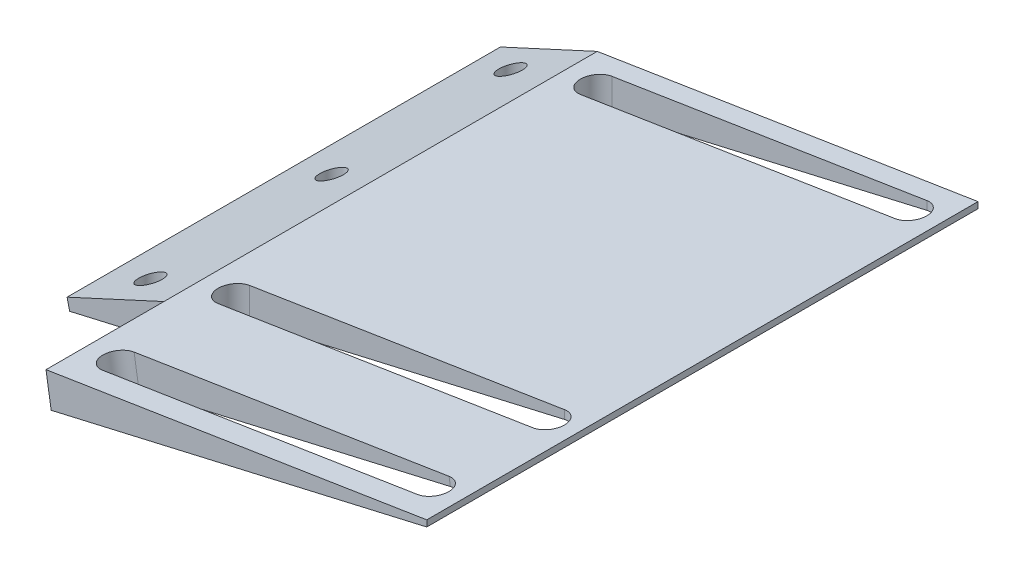
ISO-10303-21;
HEADER;
FILE_DESCRIPTION(('STEP AP214'),'2;1');
FILE_NAME('part.step','',(''),(''),'','','');
FILE_SCHEMA(('AUTOMOTIVE_DESIGN { 1 0 10303 214 1 1 1 1 }'));
ENDSEC;
DATA;
#1=APPLICATION_CONTEXT('core data for automotive mechanical design processes');
#2=APPLICATION_PROTOCOL_DEFINITION('international standard','automotive_design',2000,#1);
#3=PRODUCT_CONTEXT('',#1,'mechanical');
#4=PRODUCT('Part','Part','',(#3));
#5=PRODUCT_RELATED_PRODUCT_CATEGORY('part','',(#4));
#6=PRODUCT_DEFINITION_FORMATION('','',#4);
#7=PRODUCT_DEFINITION_CONTEXT('part definition',#1,'design');
#8=PRODUCT_DEFINITION('design','',#6,#7);
#9=PRODUCT_DEFINITION_SHAPE('','',#8);
#10=(LENGTH_UNIT() NAMED_UNIT(*) SI_UNIT(.MILLI.,.METRE.));
#11=(NAMED_UNIT(*) PLANE_ANGLE_UNIT() SI_UNIT($,.RADIAN.));
#12=(NAMED_UNIT(*) SI_UNIT($,.STERADIAN.) SOLID_ANGLE_UNIT());
#13=UNCERTAINTY_MEASURE_WITH_UNIT(LENGTH_MEASURE(1.E-05),#10,'distance_accuracy_value','');
#14=(GEOMETRIC_REPRESENTATION_CONTEXT(3) GLOBAL_UNCERTAINTY_ASSIGNED_CONTEXT((#13)) GLOBAL_UNIT_ASSIGNED_CONTEXT((#10,
#11,#12)) REPRESENTATION_CONTEXT('',''));
#15=CARTESIAN_POINT('',(0.,0.,0.));
#16=DIRECTION('',(0.,0.,1.));
#17=DIRECTION('',(1.,0.,0.));
#18=AXIS2_PLACEMENT_3D('',#15,#16,#17);
#19=CARTESIAN_POINT('',(0.,0.,110.));
#20=DIRECTION('',(0.156434465040224,-0.987688340595139,0.));
#21=DIRECTION('',(0.987688340595139,0.156434465040224,0.));
#22=AXIS2_PLACEMENT_3D('',#19,#20,#21);
#23=PLANE('',#22);
#24=DIRECTION('',(0.987688340595139,0.156434465040224,0.));
#25=VECTOR('',#24,1.);
#26=CARTESIAN_POINT('',(0.,0.,126.324079107667));
#27=LINE('',#26,#25);
#28=CARTESIAN_POINT('',(-109.820404962566,-17.3938433762093,126.324079107667));
#29=VERTEX_POINT('',#28);
#30=CARTESIAN_POINT('',(-29.8204049625664,-4.72308815024691,126.324079107667));
#31=VERTEX_POINT('',#30);
#32=EDGE_CURVE('E177',#29,#31,#27,.T.);
#33=ORIENTED_EDGE('',*,*,#32,.T.);
#34=CARTESIAN_POINT('',(-29.8204049625664,-4.72308815024691,130.324079107667));
#35=DIRECTION('',(0.156434465040224,-0.987688340595139,0.));
#36=DIRECTION('',(0.987688340595139,0.156434465040224,0.));
#37=AXIS2_PLACEMENT_3D('',#34,#35,#36);
#38=CIRCLE('',#37,4.);
#39=CARTESIAN_POINT('',(-29.8204049625664,-4.72308815024691,134.324079107667));
#40=VERTEX_POINT('',#39);
#41=EDGE_CURVE('E215',#31,#40,#38,.T.);
#42=ORIENTED_EDGE('',*,*,#41,.T.);
#43=DIRECTION('',(-0.987688340595139,-0.156434465040224,0.));
#44=VECTOR('',#43,1.);
#45=CARTESIAN_POINT('',(0.,0.,134.324079107667));
#46=LINE('',#45,#44);
#47=CARTESIAN_POINT('',(-109.820404962566,-17.3938433762093,134.324079107667));
#48=VERTEX_POINT('',#47);
#49=EDGE_CURVE('E211',#40,#48,#46,.T.);
#50=ORIENTED_EDGE('',*,*,#49,.T.);
#51=CARTESIAN_POINT('',(-109.820404962566,-17.3938433762093,130.324079107667));
#52=DIRECTION('',(0.156434465040224,-0.987688340595139,0.));
#53=DIRECTION('',(0.987688340595139,0.156434465040224,0.));
#54=AXIS2_PLACEMENT_3D('',#51,#52,#53);
#55=CIRCLE('',#54,4.00000000000002);
#56=EDGE_CURVE('E207',#48,#29,#55,.T.);
#57=ORIENTED_EDGE('',*,*,#56,.T.);
#58=EDGE_LOOP('',(#33,#42,#50,#57));
#59=FACE_BOUND('',#58,.T.);
#60=DIRECTION('',(0.987688340595139,0.156434465040224,0.));
#61=VECTOR('',#60,1.);
#62=CARTESIAN_POINT('',(0.,0.,5.00000000000002));
#63=LINE('',#62,#61);
#64=CARTESIAN_POINT('',(-109.820404962566,-17.3938433762093,4.99999999999998));
#65=VERTEX_POINT('',#64);
#66=CARTESIAN_POINT('',(-29.8204049625664,-4.72308815024691,5.00000000000001));
#67=VERTEX_POINT('',#66);
#68=EDGE_CURVE('E290',#65,#67,#63,.T.);
#69=ORIENTED_EDGE('',*,*,#68,.T.);
#70=CARTESIAN_POINT('',(-29.8204049625664,-4.7230881502469,8.99999999999998));
#71=DIRECTION('',(0.156434465040224,-0.987688340595139,0.));
#72=DIRECTION('',(0.987688340595139,0.156434465040224,0.));
#73=AXIS2_PLACEMENT_3D('',#70,#71,#72);
#74=ELLIPSE('',#73,4.049860503152,3.99999999999999);
#75=CARTESIAN_POINT('',(-29.8204049625664,-4.72308815024691,13.));
#76=VERTEX_POINT('',#75);
#77=EDGE_CURVE('E302',#67,#76,#74,.T.);
#78=ORIENTED_EDGE('',*,*,#77,.T.);
#79=DIRECTION('',(-0.987688340595139,-0.156434465040224,0.));
#80=VECTOR('',#79,1.);
#81=CARTESIAN_POINT('',(0.,0.,13.));
#82=LINE('',#81,#80);
#83=CARTESIAN_POINT('',(-109.820404962566,-17.3938433762093,13.));
#84=VERTEX_POINT('',#83);
#85=EDGE_CURVE('E298',#76,#84,#82,.T.);
#86=ORIENTED_EDGE('',*,*,#85,.T.);
#87=CARTESIAN_POINT('',(-109.820404962566,-17.3938433762093,8.99999999999997));
#88=DIRECTION('',(0.156434465040224,-0.987688340595139,0.));
#89=DIRECTION('',(0.987688340595139,0.156434465040224,0.));
#90=AXIS2_PLACEMENT_3D('',#87,#88,#89);
#91=ELLIPSE('',#90,4.04986050315203,4.00000000000003);
#92=EDGE_CURVE('E294',#84,#65,#91,.T.);
#93=ORIENTED_EDGE('',*,*,#92,.T.);
#94=EDGE_LOOP('',(#69,#78,#86,#93));
#95=FACE_BOUND('',#94,.T.);
#96=DIRECTION('',(0.987688340595139,0.156434465040224,0.));
#97=VECTOR('',#96,1.);
#98=CARTESIAN_POINT('',(0.,0.,97.));
#99=LINE('',#98,#97);
#100=CARTESIAN_POINT('',(-109.820404962566,-17.3938433762093,97.));
#101=VERTEX_POINT('',#100);
#102=CARTESIAN_POINT('',(-29.8204049625664,-4.72308815024691,97.));
#103=VERTEX_POINT('',#102);
#104=EDGE_CURVE('E274',#101,#103,#99,.T.);
#105=ORIENTED_EDGE('',*,*,#104,.T.);
#106=CARTESIAN_POINT('',(-29.8204049625664,-4.7230881502469,101.));
#107=DIRECTION('',(0.156434465040224,-0.987688340595139,0.));
#108=DIRECTION('',(0.987688340595139,0.156434465040224,0.));
#109=AXIS2_PLACEMENT_3D('',#106,#107,#108);
#110=ELLIPSE('',#109,4.049860503152,3.99999999999999);
#111=CARTESIAN_POINT('',(-29.8204049625664,-4.72308815024691,105.));
#112=VERTEX_POINT('',#111);
#113=EDGE_CURVE('E286',#103,#112,#110,.T.);
#114=ORIENTED_EDGE('',*,*,#113,.T.);
#115=DIRECTION('',(-0.987688340595139,-0.156434465040224,0.));
#116=VECTOR('',#115,1.);
#117=CARTESIAN_POINT('',(0.,0.,105.));
#118=LINE('',#117,#116);
#119=CARTESIAN_POINT('',(-109.820404962566,-17.3938433762093,105.));
#120=VERTEX_POINT('',#119);
#121=EDGE_CURVE('E282',#112,#120,#118,.T.);
#122=ORIENTED_EDGE('',*,*,#121,.T.);
#123=CARTESIAN_POINT('',(-109.820404962566,-17.3938433762093,101.));
#124=DIRECTION('',(0.156434465040224,-0.987688340595139,0.));
#125=DIRECTION('',(0.987688340595139,0.156434465040224,0.));
#126=AXIS2_PLACEMENT_3D('',#123,#124,#125);
#127=ELLIPSE('',#126,4.04986050315204,4.00000000000003);
#128=EDGE_CURVE('E278',#120,#101,#127,.T.);
#129=ORIENTED_EDGE('',*,*,#128,.T.);
#130=EDGE_LOOP('',(#105,#114,#122,#129));
#131=FACE_BOUND('',#130,.T.);
#132=DIRECTION('',(0.,0.,1.));
#133=VECTOR('',#132,1.);
#134=CARTESIAN_POINT('',(-21.8204049625664,-3.45601262765067,0.));
#135=LINE('',#134,#133);
#136=CARTESIAN_POINT('',(-21.8204049625664,-3.45601262765067,0.));
#137=VERTEX_POINT('',#136);
#138=CARTESIAN_POINT('',(-21.8204049625664,-3.45601262765067,140.));
#139=VERTEX_POINT('',#138);
#140=EDGE_CURVE('E310',#137,#139,#135,.T.);
#141=ORIENTED_EDGE('',*,*,#140,.F.);
#142=DIRECTION('',(-0.987688340595139,-0.156434465040224,0.));
#143=VECTOR('',#142,1.);
#144=CARTESIAN_POINT('',(0.,0.,0.));
#145=LINE('',#144,#143);
#146=CARTESIAN_POINT('',(-118.522600871417,-18.7721358048269,0.));
#147=VERTEX_POINT('',#146);
#148=EDGE_CURVE('E313',#137,#147,#145,.T.);
#149=ORIENTED_EDGE('',*,*,#148,.T.);
#150=DIRECTION('',(0.,0.,-1.));
#151=VECTOR('',#150,1.);
#152=CARTESIAN_POINT('',(-118.522600871417,-18.7721358048269,110.));
#153=LINE('',#152,#151);
#154=CARTESIAN_POINT('',(-118.522600871417,-18.7721358048269,110.045443527415));
#155=VERTEX_POINT('',#154);
#156=EDGE_CURVE('E337',#155,#147,#153,.T.);
#157=ORIENTED_EDGE('',*,*,#156,.F.);
#158=CARTESIAN_POINT('',(-118.522600871417,-18.7721358048269,140.));
#159=VERTEX_POINT('',#158);
#160=EDGE_CURVE('E185',#159,#155,#153,.T.);
#161=ORIENTED_EDGE('',*,*,#160,.F.);
#162=DIRECTION('',(-0.987688340595139,-0.156434465040224,0.));
#163=VECTOR('',#162,1.);
#164=CARTESIAN_POINT('',(-21.8204049625664,-3.45601262765067,140.));
#165=LINE('',#164,#163);
#166=EDGE_CURVE('E225',#139,#159,#165,.T.);
#167=ORIENTED_EDGE('',*,*,#166,.F.);
#168=EDGE_LOOP('',(#141,#149,#157,#161,#167));
#169=FACE_BOUND('',#168,.T.);
#170=ADVANCED_FACE('F39',(#59,#95,#131,#169),#23,.F.);
#171=CARTESIAN_POINT('',(0.,0.,110.));
#172=DIRECTION('',(-0.224951054343859,0.974370064785237,0.));
#173=DIRECTION('',(-0.974370064785237,-0.224951054343859,0.));
#174=AXIS2_PLACEMENT_3D('',#171,#172,#173);
#175=PLANE('',#174);
#176=DIRECTION('',(0.974370064785237,0.224951054343859,0.));
#177=VECTOR('',#176,1.);
#178=CARTESIAN_POINT('',(0.,0.,134.324079107667));
#179=LINE('',#178,#177);
#180=CARTESIAN_POINT('',(-108.604108947823,-25.0732341815868,134.324079107667));
#181=VERTEX_POINT('',#180);
#182=CARTESIAN_POINT('',(-29.4901344656915,-6.80833400014363,134.324079107667));
#183=VERTEX_POINT('',#182);
#184=EDGE_CURVE('E47',#181,#183,#179,.T.);
#185=ORIENTED_EDGE('',*,*,#184,.T.);
#186=CARTESIAN_POINT('',(-29.4901344656915,-6.80833400014362,130.324079107667));
#187=DIRECTION('',(-0.224951054343859,0.974370064785237,0.));
#188=DIRECTION('',(0.974370064785237,0.224951054343859,0.));
#189=AXIS2_PLACEMENT_3D('',#186,#187,#188);
#190=ELLIPSE('',#189,4.00976759232469,4.);
#191=CARTESIAN_POINT('',(-29.4901344656915,-6.80833400014363,126.324079107667));
#192=VERTEX_POINT('',#191);
#193=EDGE_CURVE('E11',#183,#192,#190,.T.);
#194=ORIENTED_EDGE('',*,*,#193,.T.);
#195=DIRECTION('',(-0.974370064785237,-0.224951054343859,0.));
#196=VECTOR('',#195,1.);
#197=CARTESIAN_POINT('',(0.,0.,126.324079107667));
#198=LINE('',#197,#196);
#199=CARTESIAN_POINT('',(-108.604108947823,-25.0732341815868,126.324079107667));
#200=VERTEX_POINT('',#199);
#201=EDGE_CURVE('E386',#192,#200,#198,.T.);
#202=ORIENTED_EDGE('',*,*,#201,.T.);
#203=CARTESIAN_POINT('',(-108.604108947823,-25.0732341815868,130.324079107667));
#204=DIRECTION('',(-0.224951054343859,0.974370064785237,0.));
#205=DIRECTION('',(0.974370064785237,0.224951054343859,0.));
#206=AXIS2_PLACEMENT_3D('',#203,#204,#205);
#207=ELLIPSE('',#206,4.00976759232471,4.00000000000002);
#208=EDGE_CURVE('E390',#200,#181,#207,.T.);
#209=ORIENTED_EDGE('',*,*,#208,.T.);
#210=EDGE_LOOP('',(#185,#194,#202,#209));
#211=FACE_BOUND('',#210,.T.);
#212=DIRECTION('',(0.974370064785237,0.224951054343859,0.));
#213=VECTOR('',#212,1.);
#214=CARTESIAN_POINT('',(0.,0.,13.));
#215=LINE('',#214,#213);
#216=CARTESIAN_POINT('',(-109.820404962566,-25.3540382423838,13.));
#217=VERTEX_POINT('',#216);
#218=CARTESIAN_POINT('',(-29.8204049625664,-6.88458295233928,13.));
#219=VERTEX_POINT('',#218);
#220=EDGE_CURVE('E373',#217,#219,#215,.T.);
#221=ORIENTED_EDGE('',*,*,#220,.T.);
#222=CARTESIAN_POINT('',(-29.8204049625664,-6.88458295233927,8.99999999999998));
#223=DIRECTION('',(-0.224951054343859,0.974370064785237,0.));
#224=DIRECTION('',(0.974370064785237,0.224951054343859,0.));
#225=AXIS2_PLACEMENT_3D('',#222,#223,#224);
#226=ELLIPSE('',#225,4.10521643117355,3.99999999999999);
#227=CARTESIAN_POINT('',(-29.8204049625664,-6.88458295233928,5.00000000000001));
#228=VERTEX_POINT('',#227);
#229=EDGE_CURVE('E377',#219,#228,#226,.T.);
#230=ORIENTED_EDGE('',*,*,#229,.T.);
#231=DIRECTION('',(-0.974370064785237,-0.224951054343859,0.));
#232=VECTOR('',#231,1.);
#233=CARTESIAN_POINT('',(0.,0.,5.00000000000002));
#234=LINE('',#233,#232);
#235=CARTESIAN_POINT('',(-109.820404962566,-25.3540382423838,4.99999999999998));
#236=VERTEX_POINT('',#235);
#237=EDGE_CURVE('E365',#228,#236,#234,.T.);
#238=ORIENTED_EDGE('',*,*,#237,.T.);
#239=CARTESIAN_POINT('',(-109.820404962566,-25.3540382423838,8.99999999999997));
#240=DIRECTION('',(-0.224951054343859,0.974370064785237,0.));
#241=DIRECTION('',(0.974370064785237,0.224951054343859,0.));
#242=AXIS2_PLACEMENT_3D('',#239,#240,#241);
#243=ELLIPSE('',#242,4.10521643117359,4.00000000000003);
#244=EDGE_CURVE('E369',#236,#217,#243,.T.);
#245=ORIENTED_EDGE('',*,*,#244,.T.);
#246=EDGE_LOOP('',(#221,#230,#238,#245));
#247=FACE_BOUND('',#246,.T.);
#248=CARTESIAN_POINT('',(-130.995623221144,-30.2427225784305,101.));
#249=DIRECTION('',(-0.224951054343859,0.974370064785237,0.));
#250=DIRECTION('',(0.974370064785237,0.224951054343859,0.));
#251=AXIS2_PLACEMENT_3D('',#248,#249,#250);
#252=ELLIPSE('',#251,3.07891232338016,2.99999999999999);
#253=CARTESIAN_POINT('',(-127.995623221144,-29.5501180050538,101.));
#254=VERTEX_POINT('',#253);
#255=EDGE_CURVE('E270',#254,#254,#252,.T.);
#256=ORIENTED_EDGE('',*,*,#255,.T.);
#257=EDGE_LOOP('',(#256));
#258=FACE_BOUND('',#257,.T.);
#259=CARTESIAN_POINT('',(-131.538244407152,-30.3679965501105,8.99999999999997));
#260=DIRECTION('',(-0.224951054343859,0.974370064785237,0.));
#261=DIRECTION('',(0.974370064785237,0.224951054343859,0.));
#262=AXIS2_PLACEMENT_3D('',#259,#260,#261);
#263=ELLIPSE('',#262,3.07891232338016,2.99999999999999);
#264=CARTESIAN_POINT('',(-128.538244407152,-29.6753919767338,8.99999999999997));
#265=VERTEX_POINT('',#264);
#266=EDGE_CURVE('E265',#265,#265,#263,.T.);
#267=ORIENTED_EDGE('',*,*,#266,.T.);
#268=EDGE_LOOP('',(#267));
#269=FACE_BOUND('',#268,.T.);
#270=CARTESIAN_POINT('',(-130.995623221142,-30.2427225784299,55.));
#271=DIRECTION('',(-0.224951054343859,0.974370064785237,0.));
#272=DIRECTION('',(0.974370064785237,0.224951054343859,0.));
#273=AXIS2_PLACEMENT_3D('',#270,#271,#272);
#274=ELLIPSE('',#273,3.07891232338016,2.99999999999999);
#275=CARTESIAN_POINT('',(-127.995623221142,-29.5501180050532,55.));
#276=VERTEX_POINT('',#275);
#277=EDGE_CURVE('E260',#276,#276,#274,.T.);
#278=ORIENTED_EDGE('',*,*,#277,.T.);
#279=EDGE_LOOP('',(#278));
#280=FACE_BOUND('',#279,.T.);
#281=DIRECTION('',(0.974370064785237,0.224951054343859,0.));
#282=VECTOR('',#281,1.);
#283=CARTESIAN_POINT('',(0.,0.,105.));
#284=LINE('',#283,#282);
#285=CARTESIAN_POINT('',(-109.820404962566,-25.3540382423838,105.));
#286=VERTEX_POINT('',#285);
#287=CARTESIAN_POINT('',(-29.8204049625664,-6.88458295233928,105.));
#288=VERTEX_POINT('',#287);
#289=EDGE_CURVE('E357',#286,#288,#284,.T.);
#290=ORIENTED_EDGE('',*,*,#289,.T.);
#291=CARTESIAN_POINT('',(-29.8204049625664,-6.88458295233927,101.));
#292=DIRECTION('',(-0.224951054343859,0.974370064785237,0.));
#293=DIRECTION('',(0.974370064785237,0.224951054343859,0.));
#294=AXIS2_PLACEMENT_3D('',#291,#292,#293);
#295=ELLIPSE('',#294,4.10521643117355,3.99999999999999);
#296=CARTESIAN_POINT('',(-29.8204049625664,-6.88458295233928,97.));
#297=VERTEX_POINT('',#296);
#298=EDGE_CURVE('E361',#288,#297,#295,.T.);
#299=ORIENTED_EDGE('',*,*,#298,.T.);
#300=DIRECTION('',(-0.974370064785237,-0.224951054343859,0.));
#301=VECTOR('',#300,1.);
#302=CARTESIAN_POINT('',(0.,0.,97.));
#303=LINE('',#302,#301);
#304=CARTESIAN_POINT('',(-109.820404962566,-25.3540382423838,97.));
#305=VERTEX_POINT('',#304);
#306=EDGE_CURVE('E340',#297,#305,#303,.T.);
#307=ORIENTED_EDGE('',*,*,#306,.T.);
#308=CARTESIAN_POINT('',(-109.820404962566,-25.3540382423838,101.));
#309=DIRECTION('',(-0.224951054343859,0.974370064785237,0.));
#310=DIRECTION('',(0.974370064785237,0.224951054343859,0.));
#311=AXIS2_PLACEMENT_3D('',#308,#309,#310);
#312=ELLIPSE('',#311,4.10521643117359,4.00000000000003);
#313=EDGE_CURVE('E353',#305,#286,#312,.T.);
#314=ORIENTED_EDGE('',*,*,#313,.T.);
#315=EDGE_LOOP('',(#290,#299,#307,#314));
#316=FACE_BOUND('',#315,.T.);
#317=DIRECTION('',(0.974370064785237,0.224951054343859,0.));
#318=VECTOR('',#317,1.);
#319=CARTESIAN_POINT('',(-142.475314214893,-32.8930180728377,140.));
#320=LINE('',#319,#318);
#321=CARTESIAN_POINT('',(-117.209925261215,-27.0600434270182,140.));
#322=VERTEX_POINT('',#321);
#323=CARTESIAN_POINT('',(-21.8204049625664,-5.03763742333482,140.));
#324=VERTEX_POINT('',#323);
#325=EDGE_CURVE('E191',#322,#324,#320,.T.);
#326=ORIENTED_EDGE('',*,*,#325,.F.);
#327=DIRECTION('',(0.,0.,-1.));
#328=VECTOR('',#327,1.);
#329=CARTESIAN_POINT('',(-117.209925261215,-27.0600434270182,110.));
#330=LINE('',#329,#328);
#331=CARTESIAN_POINT('',(-117.209925261215,-27.0600434270182,110.045443527415));
#332=VERTEX_POINT('',#331);
#333=EDGE_CURVE('E182',#322,#332,#330,.T.);
#334=ORIENTED_EDGE('',*,*,#333,.T.);
#335=DIRECTION('',(-0.974370064785237,-0.224951054343859,0.));
#336=VECTOR('',#335,1.);
#337=CARTESIAN_POINT('',(0.,0.,110.045443527415));
#338=LINE('',#337,#336);
#339=CARTESIAN_POINT('',(-142.475314214893,-32.8930180728377,110.045443527415));
#340=VERTEX_POINT('',#339);
#341=EDGE_CURVE('E166',#332,#340,#338,.T.);
#342=ORIENTED_EDGE('',*,*,#341,.T.);
#343=DIRECTION('',(0.,0.,-1.));
#344=VECTOR('',#343,1.);
#345=CARTESIAN_POINT('',(-142.475314214893,-32.8930180728377,110.));
#346=LINE('',#345,#344);
#347=CARTESIAN_POINT('',(-142.475314214893,-32.8930180728377,0.));
#348=VERTEX_POINT('',#347);
#349=EDGE_CURVE('E331',#340,#348,#346,.T.);
#350=ORIENTED_EDGE('',*,*,#349,.T.);
#351=DIRECTION('',(0.974370064785237,0.224951054343859,0.));
#352=VECTOR('',#351,1.);
#353=CARTESIAN_POINT('',(0.,0.,0.));
#354=LINE('',#353,#352);
#355=CARTESIAN_POINT('',(-21.8204049625664,-5.03763742333482,0.));
#356=VERTEX_POINT('',#355);
#357=EDGE_CURVE('E327',#348,#356,#354,.T.);
#358=ORIENTED_EDGE('',*,*,#357,.T.);
#359=DIRECTION('',(0.,0.,1.));
#360=VECTOR('',#359,1.);
#361=CARTESIAN_POINT('',(-21.8204049625664,-5.03763742333482,0.));
#362=LINE('',#361,#360);
#363=EDGE_CURVE('E309',#356,#324,#362,.T.);
#364=ORIENTED_EDGE('',*,*,#363,.T.);
#365=EDGE_LOOP('',(#326,#334,#342,#350,#358,#364));
#366=FACE_BOUND('',#365,.T.);
#367=ADVANCED_FACE('F189',(#211,#247,#258,#269,#280,#316,#366),#175,.F.);
#368=CARTESIAN_POINT('',(0.,0.,0.));
#369=DIRECTION('',(0.,0.,1.));
#370=DIRECTION('',(1.,0.,0.));
#371=AXIS2_PLACEMENT_3D('',#368,#369,#370);
#372=PLANE('',#371);
#373=DIRECTION('',(0.,1.,0.));
#374=VECTOR('',#373,1.);
#375=CARTESIAN_POINT('',(-21.8204049625664,0.,0.));
#376=LINE('',#375,#374);
#377=EDGE_CURVE('E306',#356,#137,#376,.T.);
#378=ORIENTED_EDGE('',*,*,#377,.F.);
#379=ORIENTED_EDGE('',*,*,#357,.F.);
#380=DIRECTION('',(0.224951054343858,-0.974370064785237,0.));
#381=VECTOR('',#380,1.);
#382=CARTESIAN_POINT('',(-143.119166496515,-30.104187448393,0.));
#383=LINE('',#382,#381);
#384=CARTESIAN_POINT('',(-143.119166496515,-30.104187448393,0.));
#385=VERTEX_POINT('',#384);
#386=EDGE_CURVE('E323',#385,#348,#383,.T.);
#387=ORIENTED_EDGE('',*,*,#386,.F.);
#388=DIRECTION('',(-0.908243113161488,-0.418442884268245,0.));
#389=VECTOR('',#388,1.);
#390=CARTESIAN_POINT('',(-118.522600871417,-18.7721358048269,0.));
#391=LINE('',#390,#389);
#392=EDGE_CURVE('E319',#147,#385,#391,.T.);
#393=ORIENTED_EDGE('',*,*,#392,.F.);
#394=ORIENTED_EDGE('',*,*,#148,.F.);
#395=EDGE_LOOP('',(#378,#379,#387,#393,#394));
#396=FACE_BOUND('',#395,.T.);
#397=ADVANCED_FACE('F427',(#396),#372,.F.);
#398=CARTESIAN_POINT('',(-118.522600871417,-18.7721358048269,110.));
#399=DIRECTION('',(0.418442884268245,-0.908243113161488,0.));
#400=DIRECTION('',(0.908243113161488,0.418442884268245,0.));
#401=AXIS2_PLACEMENT_3D('',#398,#399,#400);
#402=PLANE('',#401);
#403=CARTESIAN_POINT('',(-130.995623221144,-24.5186670715433,101.));
#404=DIRECTION('',(0.418442884268245,-0.908243113161488,0.));
#405=DIRECTION('',(0.908243113161488,0.418442884268245,0.));
#406=AXIS2_PLACEMENT_3D('',#403,#404,#405);
#407=ELLIPSE('',#406,3.30308037190323,2.99999999999999);
#408=CARTESIAN_POINT('',(-127.995623221144,-23.1365165937543,101.));
#409=VERTEX_POINT('',#408);
#410=EDGE_CURVE('E269',#409,#409,#407,.T.);
#411=ORIENTED_EDGE('',*,*,#410,.T.);
#412=EDGE_LOOP('',(#411));
#413=FACE_BOUND('',#412,.T.);
#414=CARTESIAN_POINT('',(-131.538244407152,-24.768661782043,8.99999999999997));
#415=DIRECTION('',(0.418442884268245,-0.908243113161488,0.));
#416=DIRECTION('',(0.908243113161488,0.418442884268245,0.));
#417=AXIS2_PLACEMENT_3D('',#414,#415,#416);
#418=ELLIPSE('',#417,3.30308037190323,2.99999999999999);
#419=CARTESIAN_POINT('',(-128.538244407152,-23.386511304254,8.99999999999997));
#420=VERTEX_POINT('',#419);
#421=EDGE_CURVE('E264',#420,#420,#418,.T.);
#422=ORIENTED_EDGE('',*,*,#421,.T.);
#423=EDGE_LOOP('',(#422));
#424=FACE_BOUND('',#423,.T.);
#425=CARTESIAN_POINT('',(-130.995623221142,-24.5186670715421,55.));
#426=DIRECTION('',(0.418442884268245,-0.908243113161488,0.));
#427=DIRECTION('',(0.908243113161488,0.418442884268245,0.));
#428=AXIS2_PLACEMENT_3D('',#425,#426,#427);
#429=ELLIPSE('',#428,3.30308037190323,2.99999999999999);
#430=CARTESIAN_POINT('',(-127.995623221142,-23.1365165937531,55.));
#431=VERTEX_POINT('',#430);
#432=EDGE_CURVE('E249',#431,#431,#429,.T.);
#433=ORIENTED_EDGE('',*,*,#432,.T.);
#434=EDGE_LOOP('',(#433));
#435=FACE_BOUND('',#434,.T.);
#436=DIRECTION('',(0.,0.,-1.));
#437=VECTOR('',#436,1.);
#438=CARTESIAN_POINT('',(-143.119166496515,-30.104187448393,110.));
#439=LINE('',#438,#437);
#440=CARTESIAN_POINT('',(-143.119166496515,-30.104187448393,110.045443527415));
#441=VERTEX_POINT('',#440);
#442=EDGE_CURVE('E334',#441,#385,#439,.T.);
#443=ORIENTED_EDGE('',*,*,#442,.F.);
#444=DIRECTION('',(0.908243113161488,0.418442884268245,0.));
#445=VECTOR('',#444,1.);
#446=CARTESIAN_POINT('',(-118.522600871417,-18.7721358048269,110.045443527415));
#447=LINE('',#446,#445);
#448=EDGE_CURVE('E178',#441,#155,#447,.T.);
#449=ORIENTED_EDGE('',*,*,#448,.T.);
#450=ORIENTED_EDGE('',*,*,#156,.T.);
#451=ORIENTED_EDGE('',*,*,#392,.T.);
#452=EDGE_LOOP('',(#443,#449,#450,#451));
#453=FACE_BOUND('',#452,.T.);
#454=ADVANCED_FACE('F433',(#413,#424,#435,#453),#402,.F.);
#455=CARTESIAN_POINT('',(-143.119166496515,-30.104187448393,110.));
#456=DIRECTION('',(0.974370064785237,0.224951054343858,0.));
#457=DIRECTION('',(-0.224951054343858,0.974370064785237,0.));
#458=AXIS2_PLACEMENT_3D('',#455,#456,#457);
#459=PLANE('',#458);
#460=ORIENTED_EDGE('',*,*,#349,.F.);
#461=DIRECTION('',(-0.224951054343858,0.974370064785237,0.));
#462=VECTOR('',#461,1.);
#463=CARTESIAN_POINT('',(-143.119166496515,-30.104187448393,110.045443527415));
#464=LINE('',#463,#462);
#465=EDGE_CURVE('E172',#340,#441,#464,.T.);
#466=ORIENTED_EDGE('',*,*,#465,.T.);
#467=ORIENTED_EDGE('',*,*,#442,.T.);
#468=ORIENTED_EDGE('',*,*,#386,.T.);
#469=EDGE_LOOP('',(#460,#466,#467,#468));
#470=FACE_BOUND('',#469,.T.);
#471=ADVANCED_FACE('F438',(#470),#459,.F.);
#472=CARTESIAN_POINT('',(-21.8204049625664,0.,0.));
#473=DIRECTION('',(1.,0.,0.));
#474=DIRECTION('',(0.,1.,0.));
#475=AXIS2_PLACEMENT_3D('',#472,#473,#474);
#476=PLANE('',#475);
#477=ORIENTED_EDGE('',*,*,#363,.F.);
#478=ORIENTED_EDGE('',*,*,#377,.T.);
#479=ORIENTED_EDGE('',*,*,#140,.T.);
#480=DIRECTION('',(0.,1.,0.));
#481=VECTOR('',#480,1.);
#482=CARTESIAN_POINT('',(-21.8204049625664,-5.03763742333482,140.));
#483=LINE('',#482,#481);
#484=EDGE_CURVE('E221',#324,#139,#483,.T.);
#485=ORIENTED_EDGE('',*,*,#484,.F.);
#486=EDGE_LOOP('',(#477,#478,#479,#485));
#487=FACE_BOUND('',#486,.T.);
#488=ADVANCED_FACE('F440',(#487),#476,.T.);
#489=CARTESIAN_POINT('',(-130.995623221142,-32.8930180728377,55.));
#490=DIRECTION('',(0.,1.,0.));
#491=DIRECTION('',(0.,0.,1.));
#492=AXIS2_PLACEMENT_3D('',#489,#490,#491);
#493=CYLINDRICAL_SURFACE('',#492,2.99999999999999);
#494=ORIENTED_EDGE('',*,*,#432,.F.);
#495=EDGE_LOOP('',(#494));
#496=FACE_BOUND('',#495,.T.);
#497=ORIENTED_EDGE('',*,*,#277,.F.);
#498=EDGE_LOOP('',(#497));
#499=FACE_BOUND('',#498,.T.);
#500=ADVANCED_FACE('F480',(#496,#499),#493,.F.);
#501=CARTESIAN_POINT('',(-131.538244407152,-32.8930180728377,8.99999999999997));
#502=DIRECTION('',(0.,1.,0.));
#503=DIRECTION('',(0.,0.,1.));
#504=AXIS2_PLACEMENT_3D('',#501,#502,#503);
#505=CYLINDRICAL_SURFACE('',#504,2.99999999999999);
#506=ORIENTED_EDGE('',*,*,#421,.F.);
#507=EDGE_LOOP('',(#506));
#508=FACE_BOUND('',#507,.T.);
#509=ORIENTED_EDGE('',*,*,#266,.F.);
#510=EDGE_LOOP('',(#509));
#511=FACE_BOUND('',#510,.T.);
#512=ADVANCED_FACE('F476',(#508,#511),#505,.F.);
#513=CARTESIAN_POINT('',(-130.995623221144,-32.8930180728377,101.));
#514=DIRECTION('',(0.,1.,0.));
#515=DIRECTION('',(0.,0.,1.));
#516=AXIS2_PLACEMENT_3D('',#513,#514,#515);
#517=CYLINDRICAL_SURFACE('',#516,2.99999999999999);
#518=ORIENTED_EDGE('',*,*,#410,.F.);
#519=EDGE_LOOP('',(#518));
#520=FACE_BOUND('',#519,.T.);
#521=ORIENTED_EDGE('',*,*,#255,.F.);
#522=EDGE_LOOP('',(#521));
#523=FACE_BOUND('',#522,.T.);
#524=ADVANCED_FACE('F479',(#520,#523),#517,.F.);
#525=CARTESIAN_POINT('',(-29.8204049625664,-32.8930180728377,101.));
#526=DIRECTION('',(0.,1.,0.));
#527=DIRECTION('',(0.,0.,1.));
#528=AXIS2_PLACEMENT_3D('',#525,#526,#527);
#529=CYLINDRICAL_SURFACE('',#528,3.99999999999999);
#530=DIRECTION('',(0.,1.,0.));
#531=VECTOR('',#530,1.);
#532=CARTESIAN_POINT('',(-29.8204049625664,-32.8930180728377,97.));
#533=LINE('',#532,#531);
#534=EDGE_CURVE('E234',#297,#103,#533,.T.);
#535=ORIENTED_EDGE('',*,*,#534,.F.);
#536=ORIENTED_EDGE('',*,*,#298,.F.);
#537=DIRECTION('',(0.,1.,0.));
#538=VECTOR('',#537,1.);
#539=CARTESIAN_POINT('',(-29.8204049625664,-32.8930180728377,105.));
#540=LINE('',#539,#538);
#541=EDGE_CURVE('E245',#288,#112,#540,.T.);
#542=ORIENTED_EDGE('',*,*,#541,.T.);
#543=ORIENTED_EDGE('',*,*,#113,.F.);
#544=EDGE_LOOP('',(#535,#536,#542,#543));
#545=FACE_BOUND('',#544,.T.);
#546=ADVANCED_FACE('F499',(#545),#529,.F.);
#547=CARTESIAN_POINT('',(-29.8204049625664,-32.8930180728377,105.));
#548=DIRECTION('',(0.,0.,1.));
#549=DIRECTION('',(1.,0.,0.));
#550=AXIS2_PLACEMENT_3D('',#547,#548,#549);
#551=PLANE('',#550);
#552=ORIENTED_EDGE('',*,*,#541,.F.);
#553=ORIENTED_EDGE('',*,*,#289,.F.);
#554=DIRECTION('',(0.,1.,0.));
#555=VECTOR('',#554,1.);
#556=CARTESIAN_POINT('',(-109.820404962566,-32.8930180728377,105.));
#557=LINE('',#556,#555);
#558=EDGE_CURVE('E250',#286,#120,#557,.T.);
#559=ORIENTED_EDGE('',*,*,#558,.T.);
#560=ORIENTED_EDGE('',*,*,#121,.F.);
#561=EDGE_LOOP('',(#552,#553,#559,#560));
#562=FACE_BOUND('',#561,.T.);
#563=ADVANCED_FACE('F501',(#562),#551,.F.);
#564=CARTESIAN_POINT('',(-109.820404962566,-32.8930180728377,101.));
#565=DIRECTION('',(0.,1.,0.));
#566=DIRECTION('',(0.,0.,1.));
#567=AXIS2_PLACEMENT_3D('',#564,#565,#566);
#568=CYLINDRICAL_SURFACE('',#567,4.00000000000003);
#569=ORIENTED_EDGE('',*,*,#558,.F.);
#570=ORIENTED_EDGE('',*,*,#313,.F.);
#571=DIRECTION('',(0.,1.,0.));
#572=VECTOR('',#571,1.);
#573=CARTESIAN_POINT('',(-109.820404962566,-32.8930180728377,97.));
#574=LINE('',#573,#572);
#575=EDGE_CURVE('E254',#305,#101,#574,.T.);
#576=ORIENTED_EDGE('',*,*,#575,.T.);
#577=ORIENTED_EDGE('',*,*,#128,.F.);
#578=EDGE_LOOP('',(#569,#570,#576,#577));
#579=FACE_BOUND('',#578,.T.);
#580=ADVANCED_FACE('F504',(#579),#568,.F.);
#581=CARTESIAN_POINT('',(-29.8204049625664,-32.8930180728377,97.));
#582=DIRECTION('',(0.,0.,-1.));
#583=DIRECTION('',(-1.,0.,0.));
#584=AXIS2_PLACEMENT_3D('',#581,#582,#583);
#585=PLANE('',#584);
#586=ORIENTED_EDGE('',*,*,#575,.F.);
#587=ORIENTED_EDGE('',*,*,#306,.F.);
#588=ORIENTED_EDGE('',*,*,#534,.T.);
#589=ORIENTED_EDGE('',*,*,#104,.F.);
#590=EDGE_LOOP('',(#586,#587,#588,#589));
#591=FACE_BOUND('',#590,.T.);
#592=ADVANCED_FACE('F495',(#591),#585,.F.);
#593=CARTESIAN_POINT('',(-29.8204049625664,-32.8930180728377,8.99999999999998));
#594=DIRECTION('',(0.,1.,0.));
#595=DIRECTION('',(0.,0.,1.));
#596=AXIS2_PLACEMENT_3D('',#593,#594,#595);
#597=CYLINDRICAL_SURFACE('',#596,3.99999999999999);
#598=DIRECTION('',(0.,1.,0.));
#599=VECTOR('',#598,1.);
#600=CARTESIAN_POINT('',(-29.8204049625664,-32.8930180728377,5.));
#601=LINE('',#600,#599);
#602=EDGE_CURVE('E229',#228,#67,#601,.T.);
#603=ORIENTED_EDGE('',*,*,#602,.F.);
#604=ORIENTED_EDGE('',*,*,#229,.F.);
#605=DIRECTION('',(0.,1.,0.));
#606=VECTOR('',#605,1.);
#607=CARTESIAN_POINT('',(-29.8204049625664,-32.8930180728377,13.));
#608=LINE('',#607,#606);
#609=EDGE_CURVE('E230',#219,#76,#608,.T.);
#610=ORIENTED_EDGE('',*,*,#609,.T.);
#611=ORIENTED_EDGE('',*,*,#77,.F.);
#612=EDGE_LOOP('',(#603,#604,#610,#611));
#613=FACE_BOUND('',#612,.T.);
#614=ADVANCED_FACE('F488',(#613),#597,.F.);
#615=CARTESIAN_POINT('',(-29.8204049625664,-32.8930180728377,13.));
#616=DIRECTION('',(0.,0.,1.));
#617=DIRECTION('',(1.,0.,0.));
#618=AXIS2_PLACEMENT_3D('',#615,#616,#617);
#619=PLANE('',#618);
#620=ORIENTED_EDGE('',*,*,#609,.F.);
#621=ORIENTED_EDGE('',*,*,#220,.F.);
#622=DIRECTION('',(0.,1.,0.));
#623=VECTOR('',#622,1.);
#624=CARTESIAN_POINT('',(-109.820404962566,-32.8930180728377,13.));
#625=LINE('',#624,#623);
#626=EDGE_CURVE('E235',#217,#84,#625,.T.);
#627=ORIENTED_EDGE('',*,*,#626,.T.);
#628=ORIENTED_EDGE('',*,*,#85,.F.);
#629=EDGE_LOOP('',(#620,#621,#627,#628));
#630=FACE_BOUND('',#629,.T.);
#631=ADVANCED_FACE('F485',(#630),#619,.F.);
#632=CARTESIAN_POINT('',(-109.820404962566,-32.8930180728377,8.99999999999997));
#633=DIRECTION('',(0.,1.,0.));
#634=DIRECTION('',(0.,0.,1.));
#635=AXIS2_PLACEMENT_3D('',#632,#633,#634);
#636=CYLINDRICAL_SURFACE('',#635,4.00000000000003);
#637=ORIENTED_EDGE('',*,*,#626,.F.);
#638=ORIENTED_EDGE('',*,*,#244,.F.);
#639=DIRECTION('',(0.,1.,0.));
#640=VECTOR('',#639,1.);
#641=CARTESIAN_POINT('',(-109.820404962566,-32.8930180728377,4.99999999999998));
#642=LINE('',#641,#640);
#643=EDGE_CURVE('E239',#236,#65,#642,.T.);
#644=ORIENTED_EDGE('',*,*,#643,.T.);
#645=ORIENTED_EDGE('',*,*,#92,.F.);
#646=EDGE_LOOP('',(#637,#638,#644,#645));
#647=FACE_BOUND('',#646,.T.);
#648=ADVANCED_FACE('F472',(#647),#636,.F.);
#649=CARTESIAN_POINT('',(-29.8204049625664,-32.8930180728377,5.));
#650=DIRECTION('',(0.,0.,-1.));
#651=DIRECTION('',(-1.,0.,0.));
#652=AXIS2_PLACEMENT_3D('',#649,#650,#651);
#653=PLANE('',#652);
#654=ORIENTED_EDGE('',*,*,#643,.F.);
#655=ORIENTED_EDGE('',*,*,#237,.F.);
#656=ORIENTED_EDGE('',*,*,#602,.T.);
#657=ORIENTED_EDGE('',*,*,#68,.F.);
#658=EDGE_LOOP('',(#654,#655,#656,#657));
#659=FACE_BOUND('',#658,.T.);
#660=ADVANCED_FACE('F466',(#659),#653,.F.);
#661=CARTESIAN_POINT('',(0.,0.,140.));
#662=DIRECTION('',(0.,0.,1.));
#663=DIRECTION('',(1.,0.,0.));
#664=AXIS2_PLACEMENT_3D('',#661,#662,#663);
#665=PLANE('',#664);
#666=DIRECTION('',(-0.156434465040224,0.987688340595139,0.));
#667=VECTOR('',#666,1.);
#668=CARTESIAN_POINT('',(-118.522600871417,-18.7721358048269,140.));
#669=LINE('',#668,#667);
#670=EDGE_CURVE('E381',#322,#159,#669,.T.);
#671=ORIENTED_EDGE('',*,*,#670,.F.);
#672=ORIENTED_EDGE('',*,*,#325,.T.);
#673=ORIENTED_EDGE('',*,*,#484,.T.);
#674=ORIENTED_EDGE('',*,*,#166,.T.);
#675=EDGE_LOOP('',(#671,#672,#673,#674));
#676=FACE_BOUND('',#675,.T.);
#677=ADVANCED_FACE('F464',(#676),#665,.T.);
#678=CARTESIAN_POINT('',(-113.974333398382,-47.488766451851,110.045443527415));
#679=DIRECTION('',(0.,0.,-1.));
#680=DIRECTION('',(-1.,0.,0.));
#681=AXIS2_PLACEMENT_3D('',#678,#679,#680);
#682=PLANE('',#681);
#683=DIRECTION('',(-0.156434465040224,0.987688340595139,0.));
#684=VECTOR('',#683,1.);
#685=CARTESIAN_POINT('',(-113.974333398382,-47.488766451851,110.045443527415));
#686=LINE('',#685,#684);
#687=EDGE_CURVE('E169',#332,#155,#686,.T.);
#688=ORIENTED_EDGE('',*,*,#687,.T.);
#689=ORIENTED_EDGE('',*,*,#448,.F.);
#690=ORIENTED_EDGE('',*,*,#465,.F.);
#691=ORIENTED_EDGE('',*,*,#341,.F.);
#692=EDGE_LOOP('',(#688,#689,#690,#691));
#693=FACE_BOUND('',#692,.T.);
#694=ADVANCED_FACE('F168',(#693),#682,.F.);
#695=CARTESIAN_POINT('',(-113.974333398382,-47.488766451851,140.));
#696=DIRECTION('',(0.987688340595139,0.156434465040224,0.));
#697=DIRECTION('',(-0.156434465040224,0.987688340595139,0.));
#698=AXIS2_PLACEMENT_3D('',#695,#696,#697);
#699=PLANE('',#698);
#700=ORIENTED_EDGE('',*,*,#670,.T.);
#701=ORIENTED_EDGE('',*,*,#160,.T.);
#702=ORIENTED_EDGE('',*,*,#687,.F.);
#703=ORIENTED_EDGE('',*,*,#333,.F.);
#704=EDGE_LOOP('',(#700,#701,#702,#703));
#705=FACE_BOUND('',#704,.T.);
#706=ADVANCED_FACE('F181',(#705),#699,.F.);
#707=CARTESIAN_POINT('',(-25.2721374895313,-33.439718797271,130.324079107667));
#708=DIRECTION('',(-0.156434465040224,0.987688340595139,0.));
#709=DIRECTION('',(-0.987688340595139,-0.156434465040224,0.));
#710=AXIS2_PLACEMENT_3D('',#707,#708,#709);
#711=CYLINDRICAL_SURFACE('',#710,4.);
#712=DIRECTION('',(-0.156434465040224,0.987688340595139,0.));
#713=VECTOR('',#712,1.);
#714=CARTESIAN_POINT('',(-25.2721374895313,-33.439718797271,126.324079107667));
#715=LINE('',#714,#713);
#716=EDGE_CURVE('E54',#192,#31,#715,.T.);
#717=ORIENTED_EDGE('',*,*,#716,.F.);
#718=ORIENTED_EDGE('',*,*,#193,.F.);
#719=DIRECTION('',(-0.156434465040224,0.987688340595139,0.));
#720=VECTOR('',#719,1.);
#721=CARTESIAN_POINT('',(-25.2721374895313,-33.439718797271,134.324079107667));
#722=LINE('',#721,#720);
#723=EDGE_CURVE('E193',#183,#40,#722,.T.);
#724=ORIENTED_EDGE('',*,*,#723,.T.);
#725=ORIENTED_EDGE('',*,*,#41,.F.);
#726=EDGE_LOOP('',(#717,#718,#724,#725));
#727=FACE_BOUND('',#726,.T.);
#728=ADVANCED_FACE('F411',(#727),#711,.F.);
#729=CARTESIAN_POINT('',(-25.2721374895313,-33.439718797271,134.324079107667));
#730=DIRECTION('',(0.,0.,1.));
#731=DIRECTION('',(1.,0.,0.));
#732=AXIS2_PLACEMENT_3D('',#729,#730,#731);
#733=PLANE('',#732);
#734=ORIENTED_EDGE('',*,*,#723,.F.);
#735=ORIENTED_EDGE('',*,*,#184,.F.);
#736=DIRECTION('',(-0.156434465040224,0.987688340595139,0.));
#737=VECTOR('',#736,1.);
#738=CARTESIAN_POINT('',(-105.272137489531,-46.1104740232334,134.324079107667));
#739=LINE('',#738,#737);
#740=EDGE_CURVE('E199',#181,#48,#739,.T.);
#741=ORIENTED_EDGE('',*,*,#740,.T.);
#742=ORIENTED_EDGE('',*,*,#49,.F.);
#743=EDGE_LOOP('',(#734,#735,#741,#742));
#744=FACE_BOUND('',#743,.T.);
#745=ADVANCED_FACE('F401',(#744),#733,.F.);
#746=CARTESIAN_POINT('',(-105.272137489531,-46.1104740232334,130.324079107667));
#747=DIRECTION('',(-0.156434465040224,0.987688340595139,0.));
#748=DIRECTION('',(-0.987688340595139,-0.156434465040224,0.));
#749=AXIS2_PLACEMENT_3D('',#746,#747,#748);
#750=CYLINDRICAL_SURFACE('',#749,4.00000000000002);
#751=ORIENTED_EDGE('',*,*,#740,.F.);
#752=ORIENTED_EDGE('',*,*,#208,.F.);
#753=DIRECTION('',(-0.156434465040224,0.987688340595139,0.));
#754=VECTOR('',#753,1.);
#755=CARTESIAN_POINT('',(-105.272137489531,-46.1104740232334,126.324079107667));
#756=LINE('',#755,#754);
#757=EDGE_CURVE('E59',#200,#29,#756,.T.);
#758=ORIENTED_EDGE('',*,*,#757,.T.);
#759=ORIENTED_EDGE('',*,*,#56,.F.);
#760=EDGE_LOOP('',(#751,#752,#758,#759));
#761=FACE_BOUND('',#760,.T.);
#762=ADVANCED_FACE('F403',(#761),#750,.F.);
#763=CARTESIAN_POINT('',(-25.2721374895313,-33.439718797271,126.324079107667));
#764=DIRECTION('',(0.,0.,-1.));
#765=DIRECTION('',(-1.,0.,0.));
#766=AXIS2_PLACEMENT_3D('',#763,#764,#765);
#767=PLANE('',#766);
#768=ORIENTED_EDGE('',*,*,#757,.F.);
#769=ORIENTED_EDGE('',*,*,#201,.F.);
#770=ORIENTED_EDGE('',*,*,#716,.T.);
#771=ORIENTED_EDGE('',*,*,#32,.F.);
#772=EDGE_LOOP('',(#768,#769,#770,#771));
#773=FACE_BOUND('',#772,.T.);
#774=ADVANCED_FACE('F559',(#773),#767,.F.);
#775=CLOSED_SHELL('',(#170,#367,#397,#454,#471,#488,#500,#512,#524,#546,#563,#580,#592,#614,
#631,#648,#660,#677,#694,#706,#728,#745,#762,#774));
#776=MANIFOLD_SOLID_BREP('B2',#775);
#777=ADVANCED_BREP_SHAPE_REPRESENTATION('',(#18,#776),#14);
#778=SHAPE_DEFINITION_REPRESENTATION(#9,#777);
ENDSEC;
END-ISO-10303-21;
